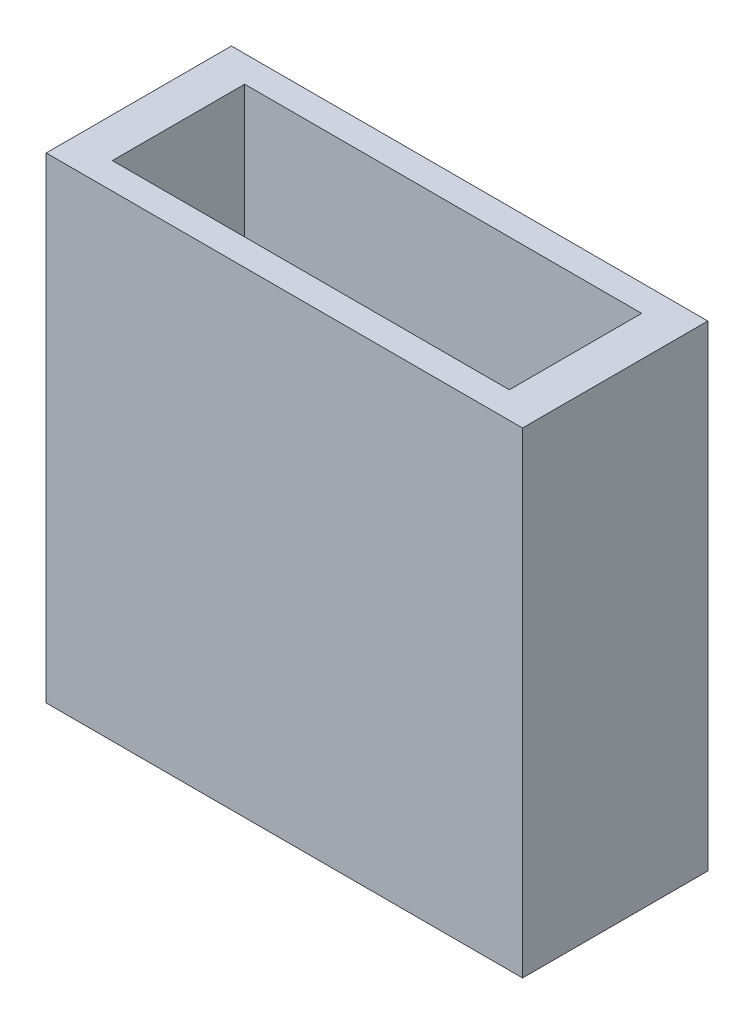
ISO-10303-21;
HEADER;
FILE_DESCRIPTION(('STEP AP214'),'2;1');
FILE_NAME('part.step','',(''),(''),'','','');
FILE_SCHEMA(('AUTOMOTIVE_DESIGN { 1 0 10303 214 1 1 1 1 }'));
ENDSEC;
DATA;
#1=APPLICATION_CONTEXT('core data for automotive mechanical design processes');
#2=APPLICATION_PROTOCOL_DEFINITION('international standard','automotive_design',2000,#1);
#3=PRODUCT_CONTEXT('',#1,'mechanical');
#4=PRODUCT('Part','Part','',(#3));
#5=PRODUCT_RELATED_PRODUCT_CATEGORY('part','',(#4));
#6=PRODUCT_DEFINITION_FORMATION('','',#4);
#7=PRODUCT_DEFINITION_CONTEXT('part definition',#1,'design');
#8=PRODUCT_DEFINITION('design','',#6,#7);
#9=PRODUCT_DEFINITION_SHAPE('','',#8);
#10=(LENGTH_UNIT() NAMED_UNIT(*) SI_UNIT(.MILLI.,.METRE.));
#11=(NAMED_UNIT(*) PLANE_ANGLE_UNIT() SI_UNIT($,.RADIAN.));
#12=(NAMED_UNIT(*) SI_UNIT($,.STERADIAN.) SOLID_ANGLE_UNIT());
#13=UNCERTAINTY_MEASURE_WITH_UNIT(LENGTH_MEASURE(1.E-05),#10,'distance_accuracy_value','');
#14=(GEOMETRIC_REPRESENTATION_CONTEXT(3) GLOBAL_UNCERTAINTY_ASSIGNED_CONTEXT((#13)) GLOBAL_UNIT_ASSIGNED_CONTEXT((#10,
#11,#12)) REPRESENTATION_CONTEXT('',''));
#15=CARTESIAN_POINT('',(0.,0.,0.));
#16=DIRECTION('',(0.,0.,1.));
#17=DIRECTION('',(1.,0.,0.));
#18=AXIS2_PLACEMENT_3D('',#15,#16,#17);
#19=CARTESIAN_POINT('',(0.,45.72,0.));
#20=DIRECTION('',(1.,0.,0.));
#21=DIRECTION('',(0.,0.,-1.));
#22=AXIS2_PLACEMENT_3D('',#19,#20,#21);
#23=PLANE('',#22);
#24=DIRECTION('',(0.,0.,1.));
#25=VECTOR('',#24,1.);
#26=CARTESIAN_POINT('',(0.,0.,0.));
#27=LINE('',#26,#25);
#28=CARTESIAN_POINT('',(0.,0.,-17.78));
#29=VERTEX_POINT('',#28);
#30=CARTESIAN_POINT('',(0.,0.,0.));
#31=VERTEX_POINT('',#30);
#32=EDGE_CURVE('E166',#29,#31,#27,.T.);
#33=ORIENTED_EDGE('',*,*,#32,.T.);
#34=DIRECTION('',(0.,-1.,0.));
#35=VECTOR('',#34,1.);
#36=CARTESIAN_POINT('',(0.,45.72,0.));
#37=LINE('',#36,#35);
#38=CARTESIAN_POINT('',(0.,45.72,0.));
#39=VERTEX_POINT('',#38);
#40=EDGE_CURVE('E11',#39,#31,#37,.T.);
#41=ORIENTED_EDGE('',*,*,#40,.F.);
#42=DIRECTION('',(0.,0.,1.));
#43=VECTOR('',#42,1.);
#44=CARTESIAN_POINT('',(0.,45.72,0.));
#45=LINE('',#44,#43);
#46=CARTESIAN_POINT('',(0.,45.72,-17.78));
#47=VERTEX_POINT('',#46);
#48=EDGE_CURVE('E172',#47,#39,#45,.T.);
#49=ORIENTED_EDGE('',*,*,#48,.F.);
#50=DIRECTION('',(0.,-1.,0.));
#51=VECTOR('',#50,1.);
#52=CARTESIAN_POINT('',(0.,45.72,-17.78));
#53=LINE('',#52,#51);
#54=EDGE_CURVE('E182',#47,#29,#53,.T.);
#55=ORIENTED_EDGE('',*,*,#54,.T.);
#56=EDGE_LOOP('',(#33,#41,#49,#55));
#57=FACE_BOUND('',#56,.T.);
#58=ADVANCED_FACE('F42',(#57),#23,.F.);
#59=CARTESIAN_POINT('',(0.,45.72,0.));
#60=DIRECTION('',(0.,0.,-1.));
#61=DIRECTION('',(-1.,0.,0.));
#62=AXIS2_PLACEMENT_3D('',#59,#60,#61);
#63=PLANE('',#62);
#64=DIRECTION('',(1.,0.,0.));
#65=VECTOR('',#64,1.);
#66=CARTESIAN_POINT('',(0.,0.,0.));
#67=LINE('',#66,#65);
#68=CARTESIAN_POINT('',(45.72,0.,0.));
#69=VERTEX_POINT('',#68);
#70=EDGE_CURVE('E186',#31,#69,#67,.T.);
#71=ORIENTED_EDGE('',*,*,#70,.T.);
#72=DIRECTION('',(0.,-1.,0.));
#73=VECTOR('',#72,1.);
#74=CARTESIAN_POINT('',(45.72,45.72,0.));
#75=LINE('',#74,#73);
#76=CARTESIAN_POINT('',(45.72,45.72,0.));
#77=VERTEX_POINT('',#76);
#78=EDGE_CURVE('E51',#77,#69,#75,.T.);
#79=ORIENTED_EDGE('',*,*,#78,.F.);
#80=DIRECTION('',(1.,0.,0.));
#81=VECTOR('',#80,1.);
#82=CARTESIAN_POINT('',(0.,45.72,0.));
#83=LINE('',#82,#81);
#84=EDGE_CURVE('E96',#39,#77,#83,.T.);
#85=ORIENTED_EDGE('',*,*,#84,.F.);
#86=ORIENTED_EDGE('',*,*,#40,.T.);
#87=EDGE_LOOP('',(#71,#79,#85,#86));
#88=FACE_BOUND('',#87,.T.);
#89=ADVANCED_FACE('F235',(#88),#63,.F.);
#90=CARTESIAN_POINT('',(45.72,45.72,0.));
#91=DIRECTION('',(-1.,0.,0.));
#92=DIRECTION('',(0.,0.,1.));
#93=AXIS2_PLACEMENT_3D('',#90,#91,#92);
#94=PLANE('',#93);
#95=DIRECTION('',(0.,0.,-1.));
#96=VECTOR('',#95,1.);
#97=CARTESIAN_POINT('',(45.72,0.,0.));
#98=LINE('',#97,#96);
#99=CARTESIAN_POINT('',(45.72,0.,-17.78));
#100=VERTEX_POINT('',#99);
#101=EDGE_CURVE('E189',#69,#100,#98,.T.);
#102=ORIENTED_EDGE('',*,*,#101,.T.);
#103=DIRECTION('',(0.,-1.,0.));
#104=VECTOR('',#103,1.);
#105=CARTESIAN_POINT('',(45.72,45.72,-17.78));
#106=LINE('',#105,#104);
#107=CARTESIAN_POINT('',(45.72,45.72,-17.78));
#108=VERTEX_POINT('',#107);
#109=EDGE_CURVE('E196',#108,#100,#106,.T.);
#110=ORIENTED_EDGE('',*,*,#109,.F.);
#111=DIRECTION('',(0.,0.,-1.));
#112=VECTOR('',#111,1.);
#113=CARTESIAN_POINT('',(45.72,45.72,0.));
#114=LINE('',#113,#112);
#115=EDGE_CURVE('E177',#77,#108,#114,.T.);
#116=ORIENTED_EDGE('',*,*,#115,.F.);
#117=ORIENTED_EDGE('',*,*,#78,.T.);
#118=EDGE_LOOP('',(#102,#110,#116,#117));
#119=FACE_BOUND('',#118,.T.);
#120=ADVANCED_FACE('F240',(#119),#94,.F.);
#121=CARTESIAN_POINT('',(0.,45.72,-17.78));
#122=DIRECTION('',(0.,0.,1.));
#123=DIRECTION('',(1.,0.,0.));
#124=AXIS2_PLACEMENT_3D('',#121,#122,#123);
#125=PLANE('',#124);
#126=DIRECTION('',(-1.,0.,0.));
#127=VECTOR('',#126,1.);
#128=CARTESIAN_POINT('',(0.,0.,-17.78));
#129=LINE('',#128,#127);
#130=EDGE_CURVE('E89',#100,#29,#129,.T.);
#131=ORIENTED_EDGE('',*,*,#130,.T.);
#132=ORIENTED_EDGE('',*,*,#54,.F.);
#133=DIRECTION('',(-1.,0.,0.));
#134=VECTOR('',#133,1.);
#135=CARTESIAN_POINT('',(0.,45.72,-17.78));
#136=LINE('',#135,#134);
#137=EDGE_CURVE('E68',#108,#47,#136,.T.);
#138=ORIENTED_EDGE('',*,*,#137,.F.);
#139=ORIENTED_EDGE('',*,*,#109,.T.);
#140=EDGE_LOOP('',(#131,#132,#138,#139));
#141=FACE_BOUND('',#140,.T.);
#142=ADVANCED_FACE('F252',(#141),#125,.F.);
#143=CARTESIAN_POINT('',(0.,45.72,0.));
#144=DIRECTION('',(0.,-1.,0.));
#145=DIRECTION('',(0.,0.,-1.));
#146=AXIS2_PLACEMENT_3D('',#143,#144,#145);
#147=PLANE('',#146);
#148=DIRECTION('',(1.,0.,0.));
#149=VECTOR('',#148,1.);
#150=CARTESIAN_POINT('',(3.81,45.72,-2.54));
#151=LINE('',#150,#149);
#152=CARTESIAN_POINT('',(3.81,45.72,-2.54));
#153=VERTEX_POINT('',#152);
#154=CARTESIAN_POINT('',(41.91,45.72,-2.54));
#155=VERTEX_POINT('',#154);
#156=EDGE_CURVE('E157',#153,#155,#151,.T.);
#157=ORIENTED_EDGE('',*,*,#156,.F.);
#158=DIRECTION('',(0.,0.,1.));
#159=VECTOR('',#158,1.);
#160=CARTESIAN_POINT('',(3.81,45.72,-2.54));
#161=LINE('',#160,#159);
#162=CARTESIAN_POINT('',(3.81,45.72,-15.24));
#163=VERTEX_POINT('',#162);
#164=EDGE_CURVE('E59',#163,#153,#161,.T.);
#165=ORIENTED_EDGE('',*,*,#164,.F.);
#166=DIRECTION('',(-1.,0.,0.));
#167=VECTOR('',#166,1.);
#168=CARTESIAN_POINT('',(3.81,45.72,-15.24));
#169=LINE('',#168,#167);
#170=CARTESIAN_POINT('',(41.91,45.72,-15.24));
#171=VERTEX_POINT('',#170);
#172=EDGE_CURVE('E141',#171,#163,#169,.T.);
#173=ORIENTED_EDGE('',*,*,#172,.F.);
#174=DIRECTION('',(0.,0.,-1.));
#175=VECTOR('',#174,1.);
#176=CARTESIAN_POINT('',(41.91,45.72,-2.54));
#177=LINE('',#176,#175);
#178=EDGE_CURVE('E145',#155,#171,#177,.T.);
#179=ORIENTED_EDGE('',*,*,#178,.F.);
#180=EDGE_LOOP('',(#157,#165,#173,#179));
#181=FACE_BOUND('',#180,.T.);
#182=ORIENTED_EDGE('',*,*,#48,.T.);
#183=ORIENTED_EDGE('',*,*,#84,.T.);
#184=ORIENTED_EDGE('',*,*,#115,.T.);
#185=ORIENTED_EDGE('',*,*,#137,.T.);
#186=EDGE_LOOP('',(#182,#183,#184,#185));
#187=FACE_BOUND('',#186,.T.);
#188=ADVANCED_FACE('F250',(#181,#187),#147,.F.);
#189=CARTESIAN_POINT('',(0.,0.,0.));
#190=DIRECTION('',(0.,-1.,0.));
#191=DIRECTION('',(0.,0.,-1.));
#192=AXIS2_PLACEMENT_3D('',#189,#190,#191);
#193=PLANE('',#192);
#194=CARTESIAN_POINT('',(28.702,0.,-8.89));
#195=DIRECTION('',(0.,1.,0.));
#196=DIRECTION('',(0.,0.,1.));
#197=AXIS2_PLACEMENT_3D('',#194,#195,#196);
#198=CIRCLE('',#197,2.54);
#199=CARTESIAN_POINT('',(28.702,0.,-6.35));
#200=VERTEX_POINT('',#199);
#201=EDGE_CURVE('E386',#200,#200,#198,.T.);
#202=ORIENTED_EDGE('',*,*,#201,.T.);
#203=EDGE_LOOP('',(#202));
#204=FACE_BOUND('',#203,.T.);
#205=CARTESIAN_POINT('',(17.018,0.,-8.89));
#206=DIRECTION('',(0.,1.,0.));
#207=DIRECTION('',(0.,0.,1.));
#208=AXIS2_PLACEMENT_3D('',#205,#206,#207);
#209=CIRCLE('',#208,2.54);
#210=CARTESIAN_POINT('',(17.018,0.,-6.35));
#211=VERTEX_POINT('',#210);
#212=EDGE_CURVE('E388',#211,#211,#209,.T.);
#213=ORIENTED_EDGE('',*,*,#212,.T.);
#214=EDGE_LOOP('',(#213));
#215=FACE_BOUND('',#214,.T.);
#216=CARTESIAN_POINT('',(22.86,0.,-8.89));
#217=DIRECTION('',(0.,1.,0.));
#218=DIRECTION('',(0.,0.,1.));
#219=AXIS2_PLACEMENT_3D('',#216,#217,#218);
#220=CIRCLE('',#219,2.4765);
#221=CARTESIAN_POINT('',(22.86,0.,-6.4135));
#222=VERTEX_POINT('',#221);
#223=EDGE_CURVE('E148',#222,#222,#220,.T.);
#224=ORIENTED_EDGE('',*,*,#223,.T.);
#225=EDGE_LOOP('',(#224));
#226=FACE_BOUND('',#225,.T.);
#227=ORIENTED_EDGE('',*,*,#32,.F.);
#228=ORIENTED_EDGE('',*,*,#130,.F.);
#229=ORIENTED_EDGE('',*,*,#101,.F.);
#230=ORIENTED_EDGE('',*,*,#70,.F.);
#231=EDGE_LOOP('',(#227,#228,#229,#230));
#232=FACE_BOUND('',#231,.T.);
#233=ADVANCED_FACE('F245',(#204,#215,#226,#232),#193,.T.);
#234=CARTESIAN_POINT('',(3.81,3.81,-2.54));
#235=DIRECTION('',(-1.,0.,0.));
#236=DIRECTION('',(0.,0.,1.));
#237=AXIS2_PLACEMENT_3D('',#234,#235,#236);
#238=PLANE('',#237);
#239=ORIENTED_EDGE('',*,*,#164,.T.);
#240=DIRECTION('',(0.,1.,0.));
#241=VECTOR('',#240,1.);
#242=CARTESIAN_POINT('',(3.81,3.81,-2.54));
#243=LINE('',#242,#241);
#244=CARTESIAN_POINT('',(3.81,3.81,-2.54));
#245=VERTEX_POINT('',#244);
#246=EDGE_CURVE('E116',#245,#153,#243,.T.);
#247=ORIENTED_EDGE('',*,*,#246,.F.);
#248=DIRECTION('',(0.,0.,1.));
#249=VECTOR('',#248,1.);
#250=CARTESIAN_POINT('',(3.81,3.81,-2.54));
#251=LINE('',#250,#249);
#252=CARTESIAN_POINT('',(3.81,3.81,-15.24));
#253=VERTEX_POINT('',#252);
#254=EDGE_CURVE('E120',#253,#245,#251,.T.);
#255=ORIENTED_EDGE('',*,*,#254,.F.);
#256=DIRECTION('',(0.,1.,0.));
#257=VECTOR('',#256,1.);
#258=CARTESIAN_POINT('',(3.81,3.81,-15.24));
#259=LINE('',#258,#257);
#260=EDGE_CURVE('E163',#253,#163,#259,.T.);
#261=ORIENTED_EDGE('',*,*,#260,.T.);
#262=EDGE_LOOP('',(#239,#247,#255,#261));
#263=FACE_BOUND('',#262,.T.);
#264=ADVANCED_FACE('F118',(#263),#238,.F.);
#265=CARTESIAN_POINT('',(3.81,3.81,-15.24));
#266=DIRECTION('',(0.,0.,-1.));
#267=DIRECTION('',(-1.,0.,0.));
#268=AXIS2_PLACEMENT_3D('',#265,#266,#267);
#269=PLANE('',#268);
#270=ORIENTED_EDGE('',*,*,#172,.T.);
#271=ORIENTED_EDGE('',*,*,#260,.F.);
#272=DIRECTION('',(-1.,0.,0.));
#273=VECTOR('',#272,1.);
#274=CARTESIAN_POINT('',(3.81,3.81,-15.24));
#275=LINE('',#274,#273);
#276=CARTESIAN_POINT('',(41.91,3.81,-15.24));
#277=VERTEX_POINT('',#276);
#278=EDGE_CURVE('E127',#277,#253,#275,.T.);
#279=ORIENTED_EDGE('',*,*,#278,.F.);
#280=DIRECTION('',(0.,1.,0.));
#281=VECTOR('',#280,1.);
#282=CARTESIAN_POINT('',(41.91,3.81,-15.24));
#283=LINE('',#282,#281);
#284=EDGE_CURVE('E167',#277,#171,#283,.T.);
#285=ORIENTED_EDGE('',*,*,#284,.T.);
#286=EDGE_LOOP('',(#270,#271,#279,#285));
#287=FACE_BOUND('',#286,.T.);
#288=ADVANCED_FACE('F295',(#287),#269,.F.);
#289=CARTESIAN_POINT('',(41.91,3.81,-2.54));
#290=DIRECTION('',(1.,0.,0.));
#291=DIRECTION('',(0.,0.,-1.));
#292=AXIS2_PLACEMENT_3D('',#289,#290,#291);
#293=PLANE('',#292);
#294=ORIENTED_EDGE('',*,*,#178,.T.);
#295=ORIENTED_EDGE('',*,*,#284,.F.);
#296=DIRECTION('',(0.,0.,-1.));
#297=VECTOR('',#296,1.);
#298=CARTESIAN_POINT('',(41.91,3.81,-2.54));
#299=LINE('',#298,#297);
#300=CARTESIAN_POINT('',(41.91,3.81,-2.54));
#301=VERTEX_POINT('',#300);
#302=EDGE_CURVE('E136',#301,#277,#299,.T.);
#303=ORIENTED_EDGE('',*,*,#302,.F.);
#304=DIRECTION('',(0.,1.,0.));
#305=VECTOR('',#304,1.);
#306=CARTESIAN_POINT('',(41.91,3.81,-2.54));
#307=LINE('',#306,#305);
#308=EDGE_CURVE('E126',#301,#155,#307,.T.);
#309=ORIENTED_EDGE('',*,*,#308,.T.);
#310=EDGE_LOOP('',(#294,#295,#303,#309));
#311=FACE_BOUND('',#310,.T.);
#312=ADVANCED_FACE('F300',(#311),#293,.F.);
#313=CARTESIAN_POINT('',(3.81,3.81,-2.54));
#314=DIRECTION('',(0.,0.,1.));
#315=DIRECTION('',(1.,0.,0.));
#316=AXIS2_PLACEMENT_3D('',#313,#314,#315);
#317=PLANE('',#316);
#318=ORIENTED_EDGE('',*,*,#156,.T.);
#319=ORIENTED_EDGE('',*,*,#308,.F.);
#320=DIRECTION('',(1.,0.,0.));
#321=VECTOR('',#320,1.);
#322=CARTESIAN_POINT('',(3.81,3.81,-2.54));
#323=LINE('',#322,#321);
#324=EDGE_CURVE('E130',#245,#301,#323,.T.);
#325=ORIENTED_EDGE('',*,*,#324,.F.);
#326=ORIENTED_EDGE('',*,*,#246,.T.);
#327=EDGE_LOOP('',(#318,#319,#325,#326));
#328=FACE_BOUND('',#327,.T.);
#329=ADVANCED_FACE('F131',(#328),#317,.F.);
#330=CARTESIAN_POINT('',(0.,3.81,0.));
#331=DIRECTION('',(0.,-1.,0.));
#332=DIRECTION('',(0.,0.,-1.));
#333=AXIS2_PLACEMENT_3D('',#330,#331,#332);
#334=PLANE('',#333);
#335=CARTESIAN_POINT('',(28.702,3.81,-8.89));
#336=DIRECTION('',(0.,-1.,0.));
#337=DIRECTION('',(0.,0.,-1.));
#338=AXIS2_PLACEMENT_3D('',#335,#336,#337);
#339=CIRCLE('',#338,2.54);
#340=CARTESIAN_POINT('',(28.702,3.81,-11.43));
#341=VERTEX_POINT('',#340);
#342=EDGE_CURVE('E45',#341,#341,#339,.F.);
#343=ORIENTED_EDGE('',*,*,#342,.F.);
#344=EDGE_LOOP('',(#343));
#345=FACE_BOUND('',#344,.T.);
#346=CARTESIAN_POINT('',(17.018,3.81,-8.89));
#347=DIRECTION('',(0.,-1.,0.));
#348=DIRECTION('',(0.,0.,-1.));
#349=AXIS2_PLACEMENT_3D('',#346,#347,#348);
#350=CIRCLE('',#349,2.54);
#351=CARTESIAN_POINT('',(17.018,3.81,-11.43));
#352=VERTEX_POINT('',#351);
#353=EDGE_CURVE('E205',#352,#352,#350,.F.);
#354=ORIENTED_EDGE('',*,*,#353,.F.);
#355=EDGE_LOOP('',(#354));
#356=FACE_BOUND('',#355,.T.);
#357=CARTESIAN_POINT('',(22.86,3.81,-8.89));
#358=DIRECTION('',(0.,-1.,0.));
#359=DIRECTION('',(0.,0.,-1.));
#360=AXIS2_PLACEMENT_3D('',#357,#358,#359);
#361=CIRCLE('',#360,2.4765);
#362=CARTESIAN_POINT('',(22.86,3.81,-11.3665));
#363=VERTEX_POINT('',#362);
#364=EDGE_CURVE('E202',#363,#363,#361,.F.);
#365=ORIENTED_EDGE('',*,*,#364,.F.);
#366=EDGE_LOOP('',(#365));
#367=FACE_BOUND('',#366,.T.);
#368=ORIENTED_EDGE('',*,*,#254,.T.);
#369=ORIENTED_EDGE('',*,*,#324,.T.);
#370=ORIENTED_EDGE('',*,*,#302,.T.);
#371=ORIENTED_EDGE('',*,*,#278,.T.);
#372=EDGE_LOOP('',(#368,#369,#370,#371));
#373=FACE_BOUND('',#372,.T.);
#374=ADVANCED_FACE('F138',(#345,#356,#367,#373),#334,.F.);
#375=CARTESIAN_POINT('',(22.86,45.72,-8.89));
#376=DIRECTION('',(0.,-1.,0.));
#377=DIRECTION('',(0.,0.,-1.));
#378=AXIS2_PLACEMENT_3D('',#375,#376,#377);
#379=CYLINDRICAL_SURFACE('',#378,2.4765);
#380=ORIENTED_EDGE('',*,*,#223,.F.);
#381=EDGE_LOOP('',(#380));
#382=FACE_BOUND('',#381,.T.);
#383=ORIENTED_EDGE('',*,*,#364,.T.);
#384=EDGE_LOOP('',(#383));
#385=FACE_BOUND('',#384,.T.);
#386=ADVANCED_FACE('F218',(#382,#385),#379,.F.);
#387=CARTESIAN_POINT('',(17.018,45.72,-8.89));
#388=DIRECTION('',(0.,-1.,0.));
#389=DIRECTION('',(0.,0.,-1.));
#390=AXIS2_PLACEMENT_3D('',#387,#388,#389);
#391=CYLINDRICAL_SURFACE('',#390,2.54);
#392=ORIENTED_EDGE('',*,*,#212,.F.);
#393=EDGE_LOOP('',(#392));
#394=FACE_BOUND('',#393,.T.);
#395=ORIENTED_EDGE('',*,*,#353,.T.);
#396=EDGE_LOOP('',(#395));
#397=FACE_BOUND('',#396,.T.);
#398=ADVANCED_FACE('F224',(#394,#397),#391,.F.);
#399=CARTESIAN_POINT('',(28.702,45.72,-8.89));
#400=DIRECTION('',(0.,-1.,0.));
#401=DIRECTION('',(0.,0.,-1.));
#402=AXIS2_PLACEMENT_3D('',#399,#400,#401);
#403=CYLINDRICAL_SURFACE('',#402,2.54);
#404=ORIENTED_EDGE('',*,*,#201,.F.);
#405=EDGE_LOOP('',(#404));
#406=FACE_BOUND('',#405,.T.);
#407=ORIENTED_EDGE('',*,*,#342,.T.);
#408=EDGE_LOOP('',(#407));
#409=FACE_BOUND('',#408,.T.);
#410=ADVANCED_FACE('F214',(#406,#409),#403,.F.);
#411=CLOSED_SHELL('',(#58,#89,#120,#142,#188,#233,#264,#288,#312,#329,#374,#386,#398,#410));
#412=MANIFOLD_SOLID_BREP('B2',#411);
#413=ADVANCED_BREP_SHAPE_REPRESENTATION('',(#18,#412),#14);
#414=SHAPE_DEFINITION_REPRESENTATION(#9,#413);
ENDSEC;
END-ISO-10303-21;
